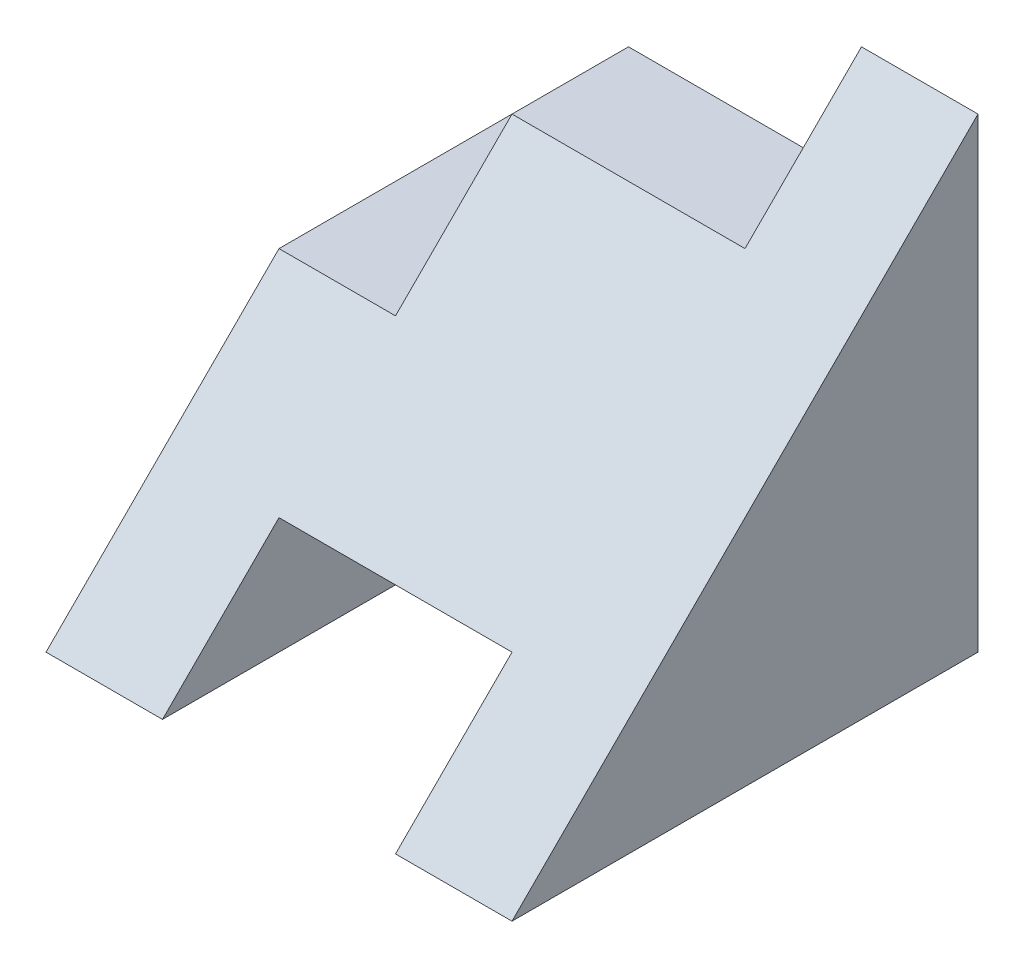
ISO-10303-21;
HEADER;
FILE_DESCRIPTION(('STEP AP214'),'2;1');
FILE_NAME('part.step','',(''),(''),'','','');
FILE_SCHEMA(('AUTOMOTIVE_DESIGN { 1 0 10303 214 1 1 1 1 }'));
ENDSEC;
DATA;
#1=APPLICATION_CONTEXT('core data for automotive mechanical design processes');
#2=APPLICATION_PROTOCOL_DEFINITION('international standard','automotive_design',2000,#1);
#3=PRODUCT_CONTEXT('',#1,'mechanical');
#4=PRODUCT('Part','Part','',(#3));
#5=PRODUCT_RELATED_PRODUCT_CATEGORY('part','',(#4));
#6=PRODUCT_DEFINITION_FORMATION('','',#4);
#7=PRODUCT_DEFINITION_CONTEXT('part definition',#1,'design');
#8=PRODUCT_DEFINITION('design','',#6,#7);
#9=PRODUCT_DEFINITION_SHAPE('','',#8);
#10=(LENGTH_UNIT() NAMED_UNIT(*) SI_UNIT(.MILLI.,.METRE.));
#11=(NAMED_UNIT(*) PLANE_ANGLE_UNIT() SI_UNIT($,.RADIAN.));
#12=(NAMED_UNIT(*) SI_UNIT($,.STERADIAN.) SOLID_ANGLE_UNIT());
#13=UNCERTAINTY_MEASURE_WITH_UNIT(LENGTH_MEASURE(1.E-05),#10,'distance_accuracy_value','');
#14=(GEOMETRIC_REPRESENTATION_CONTEXT(3) GLOBAL_UNCERTAINTY_ASSIGNED_CONTEXT((#13)) GLOBAL_UNIT_ASSIGNED_CONTEXT((#10,
#11,#12)) REPRESENTATION_CONTEXT('',''));
#15=CARTESIAN_POINT('',(0.,0.,0.));
#16=DIRECTION('',(0.,0.,1.));
#17=DIRECTION('',(1.,0.,0.));
#18=AXIS2_PLACEMENT_3D('',#15,#16,#17);
#19=CARTESIAN_POINT('',(1.,0.,4.));
#20=DIRECTION('',(0.,1.,0.));
#21=DIRECTION('',(-1.,0.,0.));
#22=AXIS2_PLACEMENT_3D('',#19,#20,#21);
#23=PLANE('',#22);
#24=DIRECTION('',(1.,0.,0.));
#25=VECTOR('',#24,1.);
#26=CARTESIAN_POINT('',(1.,0.,0.));
#27=LINE('',#26,#25);
#28=CARTESIAN_POINT('',(0.,0.,0.));
#29=VERTEX_POINT('',#28);
#30=CARTESIAN_POINT('',(1.,0.,0.));
#31=VERTEX_POINT('',#30);
#32=EDGE_CURVE('E138',#29,#31,#27,.T.);
#33=ORIENTED_EDGE('',*,*,#32,.T.);
#34=DIRECTION('',(0.,0.,-1.));
#35=VECTOR('',#34,1.);
#36=CARTESIAN_POINT('',(1.,0.,4.));
#37=LINE('',#36,#35);
#38=CARTESIAN_POINT('',(0.999999999999999,0.,4.));
#39=VERTEX_POINT('',#38);
#40=EDGE_CURVE('E11',#39,#31,#37,.T.);
#41=ORIENTED_EDGE('',*,*,#40,.F.);
#42=DIRECTION('',(1.,0.,0.));
#43=VECTOR('',#42,1.);
#44=CARTESIAN_POINT('',(1.,0.,4.));
#45=LINE('',#44,#43);
#46=CARTESIAN_POINT('',(0.,0.,4.));
#47=VERTEX_POINT('',#46);
#48=EDGE_CURVE('E117',#47,#39,#45,.T.);
#49=ORIENTED_EDGE('',*,*,#48,.F.);
#50=DIRECTION('',(0.,0.,-1.));
#51=VECTOR('',#50,1.);
#52=CARTESIAN_POINT('',(0.,0.,4.));
#53=LINE('',#52,#51);
#54=EDGE_CURVE('E122',#47,#29,#53,.T.);
#55=ORIENTED_EDGE('',*,*,#54,.T.);
#56=EDGE_LOOP('',(#33,#41,#49,#55));
#57=FACE_BOUND('',#56,.T.);
#58=ADVANCED_FACE('F33',(#57),#23,.F.);
#59=CARTESIAN_POINT('',(1.,1.,4.));
#60=DIRECTION('',(-1.,0.,0.));
#61=DIRECTION('',(0.,0.,1.));
#62=AXIS2_PLACEMENT_3D('',#59,#60,#61);
#63=PLANE('',#62);
#64=DIRECTION('',(0.,0.,-1.));
#65=VECTOR('',#64,1.);
#66=CARTESIAN_POINT('',(1.,1.,4.));
#67=LINE('',#66,#65);
#68=CARTESIAN_POINT('',(1.,1.,3.));
#69=VERTEX_POINT('',#68);
#70=CARTESIAN_POINT('',(1.,1.,0.));
#71=VERTEX_POINT('',#70);
#72=EDGE_CURVE('E40',#69,#71,#67,.T.);
#73=ORIENTED_EDGE('',*,*,#72,.F.);
#74=DIRECTION('',(0.,-0.707106781186548,0.707106781186547));
#75=VECTOR('',#74,1.);
#76=CARTESIAN_POINT('',(1.,0.5,3.5));
#77=LINE('',#76,#75);
#78=EDGE_CURVE('E135',#69,#39,#77,.T.);
#79=ORIENTED_EDGE('',*,*,#78,.T.);
#80=ORIENTED_EDGE('',*,*,#40,.T.);
#81=DIRECTION('',(0.,1.,0.));
#82=VECTOR('',#81,1.);
#83=CARTESIAN_POINT('',(1.,1.,0.));
#84=LINE('',#83,#82);
#85=EDGE_CURVE('E140',#31,#71,#84,.T.);
#86=ORIENTED_EDGE('',*,*,#85,.T.);
#87=EDGE_LOOP('',(#73,#79,#80,#86));
#88=FACE_BOUND('',#87,.T.);
#89=ADVANCED_FACE('F188',(#88),#63,.F.);
#90=CARTESIAN_POINT('',(3.,1.,4.));
#91=DIRECTION('',(0.,1.,0.));
#92=DIRECTION('',(-1.,0.,0.));
#93=AXIS2_PLACEMENT_3D('',#90,#91,#92);
#94=PLANE('',#93);
#95=DIRECTION('',(0.,0.,-1.));
#96=VECTOR('',#95,1.);
#97=CARTESIAN_POINT('',(3.,1.,4.));
#98=LINE('',#97,#96);
#99=CARTESIAN_POINT('',(3.,1.,3.));
#100=VERTEX_POINT('',#99);
#101=CARTESIAN_POINT('',(3.,1.,0.));
#102=VERTEX_POINT('',#101);
#103=EDGE_CURVE('E178',#100,#102,#98,.T.);
#104=ORIENTED_EDGE('',*,*,#103,.F.);
#105=DIRECTION('',(-1.,0.,0.));
#106=VECTOR('',#105,1.);
#107=CARTESIAN_POINT('',(3.,1.,3.));
#108=LINE('',#107,#106);
#109=EDGE_CURVE('E186',#100,#69,#108,.T.);
#110=ORIENTED_EDGE('',*,*,#109,.T.);
#111=ORIENTED_EDGE('',*,*,#72,.T.);
#112=DIRECTION('',(1.,0.,0.));
#113=VECTOR('',#112,1.);
#114=CARTESIAN_POINT('',(3.,1.,0.));
#115=LINE('',#114,#113);
#116=EDGE_CURVE('E143',#71,#102,#115,.T.);
#117=ORIENTED_EDGE('',*,*,#116,.T.);
#118=EDGE_LOOP('',(#104,#110,#111,#117));
#119=FACE_BOUND('',#118,.T.);
#120=ADVANCED_FACE('F183',(#119),#94,.F.);
#121=CARTESIAN_POINT('',(3.,0.,4.));
#122=DIRECTION('',(1.,0.,0.));
#123=DIRECTION('',(0.,0.,-1.));
#124=AXIS2_PLACEMENT_3D('',#121,#122,#123);
#125=PLANE('',#124);
#126=DIRECTION('',(0.,0.,-1.));
#127=VECTOR('',#126,1.);
#128=CARTESIAN_POINT('',(3.,0.,4.));
#129=LINE('',#128,#127);
#130=CARTESIAN_POINT('',(3.,0.,4.));
#131=VERTEX_POINT('',#130);
#132=CARTESIAN_POINT('',(3.,0.,0.));
#133=VERTEX_POINT('',#132);
#134=EDGE_CURVE('E175',#131,#133,#129,.T.);
#135=ORIENTED_EDGE('',*,*,#134,.F.);
#136=DIRECTION('',(0.,0.707106781186548,-0.707106781186547));
#137=VECTOR('',#136,1.);
#138=CARTESIAN_POINT('',(3.,0.,4.));
#139=LINE('',#138,#137);
#140=EDGE_CURVE('E203',#131,#100,#139,.T.);
#141=ORIENTED_EDGE('',*,*,#140,.T.);
#142=ORIENTED_EDGE('',*,*,#103,.T.);
#143=DIRECTION('',(0.,-1.,0.));
#144=VECTOR('',#143,1.);
#145=CARTESIAN_POINT('',(3.,0.,0.));
#146=LINE('',#145,#144);
#147=EDGE_CURVE('E146',#102,#133,#146,.T.);
#148=ORIENTED_EDGE('',*,*,#147,.T.);
#149=EDGE_LOOP('',(#135,#141,#142,#148));
#150=FACE_BOUND('',#149,.T.);
#151=ADVANCED_FACE('F195',(#150),#125,.F.);
#152=CARTESIAN_POINT('',(4.,0.,4.));
#153=DIRECTION('',(0.,1.,0.));
#154=DIRECTION('',(-1.,0.,0.));
#155=AXIS2_PLACEMENT_3D('',#152,#153,#154);
#156=PLANE('',#155);
#157=DIRECTION('',(1.,0.,0.));
#158=VECTOR('',#157,1.);
#159=CARTESIAN_POINT('',(4.,0.,0.));
#160=LINE('',#159,#158);
#161=CARTESIAN_POINT('',(4.,0.,0.));
#162=VERTEX_POINT('',#161);
#163=EDGE_CURVE('E148',#133,#162,#160,.T.);
#164=ORIENTED_EDGE('',*,*,#163,.T.);
#165=DIRECTION('',(0.,0.,-1.));
#166=VECTOR('',#165,1.);
#167=CARTESIAN_POINT('',(4.,0.,4.));
#168=LINE('',#167,#166);
#169=CARTESIAN_POINT('',(4.,0.,4.));
#170=VERTEX_POINT('',#169);
#171=EDGE_CURVE('E172',#170,#162,#168,.T.);
#172=ORIENTED_EDGE('',*,*,#171,.F.);
#173=DIRECTION('',(1.,0.,0.));
#174=VECTOR('',#173,1.);
#175=CARTESIAN_POINT('',(4.,0.,4.));
#176=LINE('',#175,#174);
#177=EDGE_CURVE('E127',#131,#170,#176,.T.);
#178=ORIENTED_EDGE('',*,*,#177,.F.);
#179=ORIENTED_EDGE('',*,*,#134,.T.);
#180=EDGE_LOOP('',(#164,#172,#178,#179));
#181=FACE_BOUND('',#180,.T.);
#182=ADVANCED_FACE('F199',(#181),#156,.F.);
#183=CARTESIAN_POINT('',(4.,4.,4.));
#184=DIRECTION('',(-1.,0.,0.));
#185=DIRECTION('',(0.,-1.,0.));
#186=AXIS2_PLACEMENT_3D('',#183,#184,#185);
#187=PLANE('',#186);
#188=DIRECTION('',(0.,1.,0.));
#189=VECTOR('',#188,1.);
#190=CARTESIAN_POINT('',(4.,4.,0.));
#191=LINE('',#190,#189);
#192=CARTESIAN_POINT('',(4.,4.,0.));
#193=VERTEX_POINT('',#192);
#194=EDGE_CURVE('E150',#162,#193,#191,.T.);
#195=ORIENTED_EDGE('',*,*,#194,.T.);
#196=DIRECTION('',(0.,-0.707106781186548,0.707106781186547));
#197=VECTOR('',#196,1.);
#198=CARTESIAN_POINT('',(4.,2.,2.));
#199=LINE('',#198,#197);
#200=EDGE_CURVE('E202',#193,#170,#199,.T.);
#201=ORIENTED_EDGE('',*,*,#200,.T.);
#202=ORIENTED_EDGE('',*,*,#171,.T.);
#203=EDGE_LOOP('',(#195,#201,#202));
#204=FACE_BOUND('',#203,.T.);
#205=ADVANCED_FACE('F205',(#204),#187,.F.);
#206=CARTESIAN_POINT('',(3.,3.,4.));
#207=DIRECTION('',(1.,0.,0.));
#208=DIRECTION('',(0.,0.,-1.));
#209=AXIS2_PLACEMENT_3D('',#206,#207,#208);
#210=PLANE('',#209);
#211=DIRECTION('',(0.,0.,-1.));
#212=VECTOR('',#211,1.);
#213=CARTESIAN_POINT('',(3.,3.,4.));
#214=LINE('',#213,#212);
#215=CARTESIAN_POINT('',(3.,3.,1.));
#216=VERTEX_POINT('',#215);
#217=CARTESIAN_POINT('',(3.,3.,0.));
#218=VERTEX_POINT('',#217);
#219=EDGE_CURVE('E170',#216,#218,#214,.T.);
#220=ORIENTED_EDGE('',*,*,#219,.F.);
#221=DIRECTION('',(0.,0.707106781186548,-0.707106781186547));
#222=VECTOR('',#221,1.);
#223=CARTESIAN_POINT('',(3.,1.5,2.5));
#224=LINE('',#223,#222);
#225=CARTESIAN_POINT('',(3.,4.,0.));
#226=VERTEX_POINT('',#225);
#227=EDGE_CURVE('E207',#216,#226,#224,.T.);
#228=ORIENTED_EDGE('',*,*,#227,.T.);
#229=DIRECTION('',(0.,-1.,0.));
#230=VECTOR('',#229,1.);
#231=CARTESIAN_POINT('',(3.,3.,0.));
#232=LINE('',#231,#230);
#233=EDGE_CURVE('E155',#226,#218,#232,.T.);
#234=ORIENTED_EDGE('',*,*,#233,.T.);
#235=EDGE_LOOP('',(#220,#228,#234));
#236=FACE_BOUND('',#235,.T.);
#237=ADVANCED_FACE('F233',(#236),#210,.F.);
#238=CARTESIAN_POINT('',(1.,3.,4.));
#239=DIRECTION('',(0.,-1.,0.));
#240=DIRECTION('',(0.,0.,-1.));
#241=AXIS2_PLACEMENT_3D('',#238,#239,#240);
#242=PLANE('',#241);
#243=DIRECTION('',(0.,0.,-1.));
#244=VECTOR('',#243,1.);
#245=CARTESIAN_POINT('',(1.,3.,4.));
#246=LINE('',#245,#244);
#247=CARTESIAN_POINT('',(1.,3.,1.));
#248=VERTEX_POINT('',#247);
#249=CARTESIAN_POINT('',(1.,3.,0.));
#250=VERTEX_POINT('',#249);
#251=EDGE_CURVE('E168',#248,#250,#246,.T.);
#252=ORIENTED_EDGE('',*,*,#251,.F.);
#253=DIRECTION('',(1.,0.,0.));
#254=VECTOR('',#253,1.);
#255=CARTESIAN_POINT('',(1.,3.,1.));
#256=LINE('',#255,#254);
#257=EDGE_CURVE('E211',#248,#216,#256,.T.);
#258=ORIENTED_EDGE('',*,*,#257,.T.);
#259=ORIENTED_EDGE('',*,*,#219,.T.);
#260=DIRECTION('',(-1.,0.,0.));
#261=VECTOR('',#260,1.);
#262=CARTESIAN_POINT('',(1.,3.,0.));
#263=LINE('',#262,#261);
#264=EDGE_CURVE('E158',#218,#250,#263,.T.);
#265=ORIENTED_EDGE('',*,*,#264,.T.);
#266=EDGE_LOOP('',(#252,#258,#259,#265));
#267=FACE_BOUND('',#266,.T.);
#268=ADVANCED_FACE('F230',(#267),#242,.F.);
#269=CARTESIAN_POINT('',(1.,2.,4.));
#270=DIRECTION('',(1.,0.,0.));
#271=DIRECTION('',(0.,0.,-1.));
#272=AXIS2_PLACEMENT_3D('',#269,#270,#271);
#273=PLANE('',#272);
#274=DIRECTION('',(0.,0.,-1.));
#275=VECTOR('',#274,1.);
#276=CARTESIAN_POINT('',(1.,2.,4.));
#277=LINE('',#276,#275);
#278=CARTESIAN_POINT('',(1.,2.,2.));
#279=VERTEX_POINT('',#278);
#280=CARTESIAN_POINT('',(1.,2.,0.));
#281=VERTEX_POINT('',#280);
#282=EDGE_CURVE('E166',#279,#281,#277,.T.);
#283=ORIENTED_EDGE('',*,*,#282,.F.);
#284=DIRECTION('',(0.,0.707106781186548,-0.707106781186547));
#285=VECTOR('',#284,1.);
#286=CARTESIAN_POINT('',(1.,1.,3.));
#287=LINE('',#286,#285);
#288=EDGE_CURVE('E216',#279,#248,#287,.T.);
#289=ORIENTED_EDGE('',*,*,#288,.T.);
#290=ORIENTED_EDGE('',*,*,#251,.T.);
#291=DIRECTION('',(0.,-1.,0.));
#292=VECTOR('',#291,1.);
#293=CARTESIAN_POINT('',(1.,2.,0.));
#294=LINE('',#293,#292);
#295=EDGE_CURVE('E161',#250,#281,#294,.T.);
#296=ORIENTED_EDGE('',*,*,#295,.T.);
#297=EDGE_LOOP('',(#283,#289,#290,#296));
#298=FACE_BOUND('',#297,.T.);
#299=ADVANCED_FACE('F223',(#298),#273,.F.);
#300=CARTESIAN_POINT('',(0.,2.,4.));
#301=DIRECTION('',(0.,-1.,0.));
#302=DIRECTION('',(1.,0.,0.));
#303=AXIS2_PLACEMENT_3D('',#300,#301,#302);
#304=PLANE('',#303);
#305=DIRECTION('',(0.,0.,-1.));
#306=VECTOR('',#305,1.);
#307=CARTESIAN_POINT('',(0.,2.,4.));
#308=LINE('',#307,#306);
#309=CARTESIAN_POINT('',(0.,2.,2.));
#310=VERTEX_POINT('',#309);
#311=CARTESIAN_POINT('',(0.,2.,0.));
#312=VERTEX_POINT('',#311);
#313=EDGE_CURVE('E52',#310,#312,#308,.T.);
#314=ORIENTED_EDGE('',*,*,#313,.F.);
#315=DIRECTION('',(1.,0.,0.));
#316=VECTOR('',#315,1.);
#317=CARTESIAN_POINT('',(0.,2.,2.));
#318=LINE('',#317,#316);
#319=EDGE_CURVE('E120',#310,#279,#318,.T.);
#320=ORIENTED_EDGE('',*,*,#319,.T.);
#321=ORIENTED_EDGE('',*,*,#282,.T.);
#322=DIRECTION('',(-1.,0.,0.));
#323=VECTOR('',#322,1.);
#324=CARTESIAN_POINT('',(0.,2.,0.));
#325=LINE('',#324,#323);
#326=EDGE_CURVE('E132',#281,#312,#325,.T.);
#327=ORIENTED_EDGE('',*,*,#326,.T.);
#328=EDGE_LOOP('',(#314,#320,#321,#327));
#329=FACE_BOUND('',#328,.T.);
#330=ADVANCED_FACE('F221',(#329),#304,.F.);
#331=CARTESIAN_POINT('',(0.,0.,4.));
#332=DIRECTION('',(1.,0.,0.));
#333=DIRECTION('',(0.,0.,-1.));
#334=AXIS2_PLACEMENT_3D('',#331,#332,#333);
#335=PLANE('',#334);
#336=ORIENTED_EDGE('',*,*,#54,.F.);
#337=DIRECTION('',(0.,-0.707106781186548,0.707106781186547));
#338=VECTOR('',#337,1.);
#339=CARTESIAN_POINT('',(0.,0.,4.));
#340=LINE('',#339,#338);
#341=EDGE_CURVE('E114',#310,#47,#340,.T.);
#342=ORIENTED_EDGE('',*,*,#341,.F.);
#343=ORIENTED_EDGE('',*,*,#313,.T.);
#344=DIRECTION('',(0.,-1.,0.));
#345=VECTOR('',#344,1.);
#346=CARTESIAN_POINT('',(0.,0.,0.));
#347=LINE('',#346,#345);
#348=EDGE_CURVE('E47',#312,#29,#347,.T.);
#349=ORIENTED_EDGE('',*,*,#348,.T.);
#350=EDGE_LOOP('',(#336,#342,#343,#349));
#351=FACE_BOUND('',#350,.T.);
#352=ADVANCED_FACE('F123',(#351),#335,.F.);
#353=CARTESIAN_POINT('',(0.,0.,0.));
#354=DIRECTION('',(0.,0.,-1.));
#355=DIRECTION('',(-1.,0.,0.));
#356=AXIS2_PLACEMENT_3D('',#353,#354,#355);
#357=PLANE('',#356);
#358=ORIENTED_EDGE('',*,*,#32,.F.);
#359=ORIENTED_EDGE('',*,*,#348,.F.);
#360=ORIENTED_EDGE('',*,*,#326,.F.);
#361=ORIENTED_EDGE('',*,*,#295,.F.);
#362=ORIENTED_EDGE('',*,*,#264,.F.);
#363=ORIENTED_EDGE('',*,*,#233,.F.);
#364=DIRECTION('',(-1.,0.,0.));
#365=VECTOR('',#364,1.);
#366=CARTESIAN_POINT('',(3.,4.,0.));
#367=LINE('',#366,#365);
#368=EDGE_CURVE('E153',#193,#226,#367,.T.);
#369=ORIENTED_EDGE('',*,*,#368,.F.);
#370=ORIENTED_EDGE('',*,*,#194,.F.);
#371=ORIENTED_EDGE('',*,*,#163,.F.);
#372=ORIENTED_EDGE('',*,*,#147,.F.);
#373=ORIENTED_EDGE('',*,*,#116,.F.);
#374=ORIENTED_EDGE('',*,*,#85,.F.);
#375=EDGE_LOOP('',(#358,#359,#360,#361,#362,#363,#369,#370,#371,#372,#373,#374));
#376=FACE_BOUND('',#375,.T.);
#377=ADVANCED_FACE('F190',(#376),#357,.T.);
#378=CARTESIAN_POINT('',(10.,0.,4.));
#379=DIRECTION('',(0.,-0.707106781186547,-0.707106781186548));
#380=DIRECTION('',(0.,0.707106781186548,-0.707106781186547));
#381=AXIS2_PLACEMENT_3D('',#378,#379,#380);
#382=PLANE('',#381);
#383=ORIENTED_EDGE('',*,*,#109,.F.);
#384=ORIENTED_EDGE('',*,*,#140,.F.);
#385=ORIENTED_EDGE('',*,*,#177,.T.);
#386=ORIENTED_EDGE('',*,*,#200,.F.);
#387=ORIENTED_EDGE('',*,*,#368,.T.);
#388=ORIENTED_EDGE('',*,*,#227,.F.);
#389=ORIENTED_EDGE('',*,*,#257,.F.);
#390=ORIENTED_EDGE('',*,*,#288,.F.);
#391=ORIENTED_EDGE('',*,*,#319,.F.);
#392=ORIENTED_EDGE('',*,*,#341,.T.);
#393=ORIENTED_EDGE('',*,*,#48,.T.);
#394=ORIENTED_EDGE('',*,*,#78,.F.);
#395=EDGE_LOOP('',(#383,#384,#385,#386,#387,#388,#389,#390,#391,#392,#393,#394));
#396=FACE_BOUND('',#395,.T.);
#397=ADVANCED_FACE('F115',(#396),#382,.F.);
#398=CLOSED_SHELL('',(#58,#89,#120,#151,#182,#205,#237,#268,#299,#330,#352,#377,#397));
#399=MANIFOLD_SOLID_BREP('B2',#398);
#400=ADVANCED_BREP_SHAPE_REPRESENTATION('',(#18,#399),#14);
#401=SHAPE_DEFINITION_REPRESENTATION(#9,#400);
ENDSEC;
END-ISO-10303-21;
